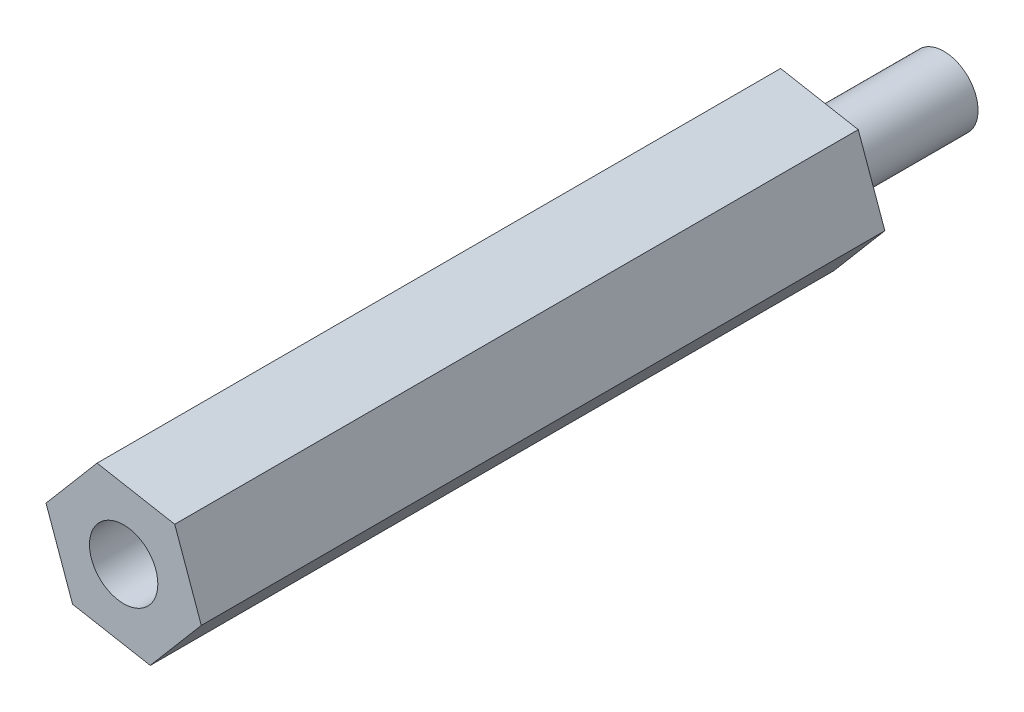
ISO-10303-21;
HEADER;
FILE_DESCRIPTION(('STEP AP214'),'2;1');
FILE_NAME('part.step','',(''),(''),'','','');
FILE_SCHEMA(('AUTOMOTIVE_DESIGN { 1 0 10303 214 1 1 1 1 }'));
ENDSEC;
DATA;
#1=APPLICATION_CONTEXT('core data for automotive mechanical design processes');
#2=APPLICATION_PROTOCOL_DEFINITION('international standard','automotive_design',2000,#1);
#3=PRODUCT_CONTEXT('',#1,'mechanical');
#4=PRODUCT('Part','Part','',(#3));
#5=PRODUCT_RELATED_PRODUCT_CATEGORY('part','',(#4));
#6=PRODUCT_DEFINITION_FORMATION('','',#4);
#7=PRODUCT_DEFINITION_CONTEXT('part definition',#1,'design');
#8=PRODUCT_DEFINITION('design','',#6,#7);
#9=PRODUCT_DEFINITION_SHAPE('','',#8);
#10=(LENGTH_UNIT() NAMED_UNIT(*) SI_UNIT(.MILLI.,.METRE.));
#11=(NAMED_UNIT(*) PLANE_ANGLE_UNIT() SI_UNIT($,.RADIAN.));
#12=(NAMED_UNIT(*) SI_UNIT($,.STERADIAN.) SOLID_ANGLE_UNIT());
#13=UNCERTAINTY_MEASURE_WITH_UNIT(LENGTH_MEASURE(1.E-05),#10,'distance_accuracy_value','');
#14=(GEOMETRIC_REPRESENTATION_CONTEXT(3) GLOBAL_UNCERTAINTY_ASSIGNED_CONTEXT((#13)) GLOBAL_UNIT_ASSIGNED_CONTEXT((#10,
#11,#12)) REPRESENTATION_CONTEXT('',''));
#15=CARTESIAN_POINT('',(0.,0.,0.));
#16=DIRECTION('',(0.,0.,1.));
#17=DIRECTION('',(1.,0.,0.));
#18=AXIS2_PLACEMENT_3D('',#15,#16,#17);
#19=CARTESIAN_POINT('',(10.6919799005155,-6.78529493686556,-6.));
#20=DIRECTION('',(0.,0.,1.));
#21=DIRECTION('',(1.,0.,0.));
#22=AXIS2_PLACEMENT_3D('',#19,#20,#21);
#23=CYLINDRICAL_SURFACE('',#22,1.5);
#24=CARTESIAN_POINT('',(10.6919799005155,-6.78529493686556,-6.));
#25=DIRECTION('',(0.,0.,-1.));
#26=DIRECTION('',(-1.,0.,0.));
#27=AXIS2_PLACEMENT_3D('',#24,#25,#26);
#28=CIRCLE('',#27,1.5);
#29=CARTESIAN_POINT('',(9.19197990051546,-6.78529493686556,-6.));
#30=VERTEX_POINT('',#29);
#31=EDGE_CURVE('E11',#30,#30,#28,.T.);
#32=ORIENTED_EDGE('',*,*,#31,.F.);
#33=EDGE_LOOP('',(#32));
#34=FACE_BOUND('',#33,.T.);
#35=CARTESIAN_POINT('',(10.6919799005155,-6.78529493686556,0.));
#36=DIRECTION('',(0.,0.,-1.));
#37=DIRECTION('',(-1.,0.,0.));
#38=AXIS2_PLACEMENT_3D('',#35,#36,#37);
#39=CIRCLE('',#38,1.5);
#40=CARTESIAN_POINT('',(9.19197990051546,-6.78529493686556,0.));
#41=VERTEX_POINT('',#40);
#42=EDGE_CURVE('E44',#41,#41,#39,.T.);
#43=ORIENTED_EDGE('',*,*,#42,.T.);
#44=EDGE_LOOP('',(#43));
#45=FACE_BOUND('',#44,.T.);
#46=ADVANCED_FACE('F41',(#34,#45),#23,.T.);
#47=CARTESIAN_POINT('',(10.6919799005155,-6.78529493686556,-6.));
#48=DIRECTION('',(0.,0.,-1.));
#49=DIRECTION('',(-1.,0.,0.));
#50=AXIS2_PLACEMENT_3D('',#47,#48,#49);
#51=PLANE('',#50);
#52=ORIENTED_EDGE('',*,*,#31,.T.);
#53=EDGE_LOOP('',(#52));
#54=FACE_BOUND('',#53,.T.);
#55=ADVANCED_FACE('F56',(#54),#51,.T.);
#56=CARTESIAN_POINT('',(10.6919799005155,-6.78529493686556,0.));
#57=DIRECTION('',(0.,0.,-1.));
#58=DIRECTION('',(-1.,0.,0.));
#59=AXIS2_PLACEMENT_3D('',#56,#57,#58);
#60=PLANE('',#59);
#61=ORIENTED_EDGE('',*,*,#42,.F.);
#62=EDGE_LOOP('',(#61));
#63=FACE_BOUND('',#62,.T.);
#64=ADVANCED_FACE('F54',(#63),#60,.F.);
#65=CLOSED_SHELL('',(#46,#55,#64));
#66=MANIFOLD_SOLID_BREP('B2',#65);
#67=CARTESIAN_POINT('',(14.100105118259,-7.40552271774973,30.));
#68=DIRECTION('',(-0.941553473498977,-0.336863557753005,0.));
#69=DIRECTION('',(0.336863557753005,-0.941553473498977,0.));
#70=AXIS2_PLACEMENT_3D('',#67,#68,#69);
#71=PLANE('',#70);
#72=DIRECTION('',(-0.336863557753005,0.941553473498977,0.));
#73=VECTOR('',#72,1.);
#74=CARTESIAN_POINT('',(14.100105118259,-7.40552271774973,0.));
#75=LINE('',#74,#73);
#76=CARTESIAN_POINT('',(14.100105118259,-7.40552271774973,0.));
#77=VERTEX_POINT('',#76);
#78=CARTESIAN_POINT('',(12.9331755237658,-4.14388580946336,0.));
#79=VERTEX_POINT('',#78);
#80=EDGE_CURVE('E166',#77,#79,#75,.T.);
#81=ORIENTED_EDGE('',*,*,#80,.T.);
#82=DIRECTION('',(0.,0.,-1.));
#83=VECTOR('',#82,1.);
#84=CARTESIAN_POINT('',(12.9331755237658,-4.14388580946336,30.));
#85=LINE('',#84,#83);
#86=CARTESIAN_POINT('',(12.9331755237658,-4.14388580946336,30.));
#87=VERTEX_POINT('',#86);
#88=EDGE_CURVE('E39',#87,#79,#85,.T.);
#89=ORIENTED_EDGE('',*,*,#88,.F.);
#90=DIRECTION('',(-0.336863557753005,0.941553473498977,0.));
#91=VECTOR('',#90,1.);
#92=CARTESIAN_POINT('',(14.100105118259,-7.40552271774973,30.));
#93=LINE('',#92,#91);
#94=CARTESIAN_POINT('',(14.100105118259,-7.40552271774973,30.));
#95=VERTEX_POINT('',#94);
#96=EDGE_CURVE('E177',#95,#87,#93,.T.);
#97=ORIENTED_EDGE('',*,*,#96,.F.);
#98=DIRECTION('',(0.,0.,-1.));
#99=VECTOR('',#98,1.);
#100=CARTESIAN_POINT('',(14.100105118259,-7.40552271774973,30.));
#101=LINE('',#100,#99);
#102=EDGE_CURVE('E162',#95,#77,#101,.T.);
#103=ORIENTED_EDGE('',*,*,#102,.T.);
#104=EDGE_LOOP('',(#81,#89,#97,#103));
#105=FACE_BOUND('',#104,.T.);
#106=ADVANCED_FACE('F82',(#105),#71,.F.);
#107=CARTESIAN_POINT('',(12.9331755237658,-4.14388580946336,30.));
#108=DIRECTION('',(-0.17904433812618,-0.983841005948094,0.));
#109=DIRECTION('',(0.983841005948094,-0.17904433812618,0.));
#110=AXIS2_PLACEMENT_3D('',#107,#108,#109);
#111=PLANE('',#110);
#112=DIRECTION('',(-0.983841005948094,0.17904433812618,0.));
#113=VECTOR('',#112,1.);
#114=CARTESIAN_POINT('',(12.9331755237658,-4.14388580946336,0.));
#115=LINE('',#114,#113);
#116=CARTESIAN_POINT('',(9.52505030602222,-3.52365802857919,0.));
#117=VERTEX_POINT('',#116);
#118=EDGE_CURVE('E169',#79,#117,#115,.T.);
#119=ORIENTED_EDGE('',*,*,#118,.T.);
#120=DIRECTION('',(0.,0.,-1.));
#121=VECTOR('',#120,1.);
#122=CARTESIAN_POINT('',(9.52505030602222,-3.52365802857919,30.));
#123=LINE('',#122,#121);
#124=CARTESIAN_POINT('',(9.52505030602222,-3.52365802857919,30.));
#125=VERTEX_POINT('',#124);
#126=EDGE_CURVE('E90',#125,#117,#123,.T.);
#127=ORIENTED_EDGE('',*,*,#126,.F.);
#128=DIRECTION('',(-0.983841005948094,0.17904433812618,0.));
#129=VECTOR('',#128,1.);
#130=CARTESIAN_POINT('',(12.9331755237658,-4.14388580946336,30.));
#131=LINE('',#130,#129);
#132=EDGE_CURVE('E135',#87,#125,#131,.T.);
#133=ORIENTED_EDGE('',*,*,#132,.F.);
#134=ORIENTED_EDGE('',*,*,#88,.T.);
#135=EDGE_LOOP('',(#119,#127,#133,#134));
#136=FACE_BOUND('',#135,.T.);
#137=ADVANCED_FACE('F202',(#136),#111,.F.);
#138=CARTESIAN_POINT('',(9.52505030602222,-3.52365802857919,30.));
#139=DIRECTION('',(0.762509135372797,-0.64697744819509,0.));
#140=DIRECTION('',(0.64697744819509,0.762509135372797,0.));
#141=AXIS2_PLACEMENT_3D('',#138,#139,#140);
#142=PLANE('',#141);
#143=DIRECTION('',(-0.64697744819509,-0.762509135372797,0.));
#144=VECTOR('',#143,1.);
#145=CARTESIAN_POINT('',(9.52505030602222,-3.52365802857919,0.));
#146=LINE('',#145,#144);
#147=CARTESIAN_POINT('',(7.28385468277191,-6.16506715598138,0.));
#148=VERTEX_POINT('',#147);
#149=EDGE_CURVE('E172',#117,#148,#146,.T.);
#150=ORIENTED_EDGE('',*,*,#149,.T.);
#151=DIRECTION('',(0.,0.,-1.));
#152=VECTOR('',#151,1.);
#153=CARTESIAN_POINT('',(7.28385468277191,-6.16506715598138,30.));
#154=LINE('',#153,#152);
#155=CARTESIAN_POINT('',(7.28385468277191,-6.16506715598138,30.));
#156=VERTEX_POINT('',#155);
#157=EDGE_CURVE('E157',#156,#148,#154,.T.);
#158=ORIENTED_EDGE('',*,*,#157,.F.);
#159=DIRECTION('',(-0.64697744819509,-0.762509135372797,0.));
#160=VECTOR('',#159,1.);
#161=CARTESIAN_POINT('',(9.52505030602222,-3.52365802857919,30.));
#162=LINE('',#161,#160);
#163=EDGE_CURVE('E148',#125,#156,#162,.T.);
#164=ORIENTED_EDGE('',*,*,#163,.F.);
#165=ORIENTED_EDGE('',*,*,#126,.T.);
#166=EDGE_LOOP('',(#150,#158,#164,#165));
#167=FACE_BOUND('',#166,.T.);
#168=ADVANCED_FACE('F183',(#167),#142,.F.);
#169=CARTESIAN_POINT('',(7.28385468277191,-6.16506715598138,30.));
#170=DIRECTION('',(0.941553473498977,0.336863557753005,0.));
#171=DIRECTION('',(-0.336863557753005,0.941553473498977,0.));
#172=AXIS2_PLACEMENT_3D('',#169,#170,#171);
#173=PLANE('',#172);
#174=DIRECTION('',(0.336863557753005,-0.941553473498977,0.));
#175=VECTOR('',#174,1.);
#176=CARTESIAN_POINT('',(7.28385468277191,-6.16506715598138,0.));
#177=LINE('',#176,#175);
#178=CARTESIAN_POINT('',(8.45078427726515,-9.42670406426776,0.));
#179=VERTEX_POINT('',#178);
#180=EDGE_CURVE('E156',#148,#179,#177,.T.);
#181=ORIENTED_EDGE('',*,*,#180,.T.);
#182=DIRECTION('',(0.,0.,-1.));
#183=VECTOR('',#182,1.);
#184=CARTESIAN_POINT('',(8.45078427726515,-9.42670406426776,30.));
#185=LINE('',#184,#183);
#186=CARTESIAN_POINT('',(8.45078427726515,-9.42670406426776,30.));
#187=VERTEX_POINT('',#186);
#188=EDGE_CURVE('E153',#187,#179,#185,.T.);
#189=ORIENTED_EDGE('',*,*,#188,.F.);
#190=DIRECTION('',(0.336863557753005,-0.941553473498977,0.));
#191=VECTOR('',#190,1.);
#192=CARTESIAN_POINT('',(7.28385468277191,-6.16506715598138,30.));
#193=LINE('',#192,#191);
#194=EDGE_CURVE('E142',#156,#187,#193,.T.);
#195=ORIENTED_EDGE('',*,*,#194,.F.);
#196=ORIENTED_EDGE('',*,*,#157,.T.);
#197=EDGE_LOOP('',(#181,#189,#195,#196));
#198=FACE_BOUND('',#197,.T.);
#199=ADVANCED_FACE('F154',(#198),#173,.F.);
#200=CARTESIAN_POINT('',(8.45078427726515,-9.42670406426776,30.));
#201=DIRECTION('',(0.17904433812618,0.983841005948094,0.));
#202=DIRECTION('',(-0.983841005948094,0.17904433812618,0.));
#203=AXIS2_PLACEMENT_3D('',#200,#201,#202);
#204=PLANE('',#203);
#205=DIRECTION('',(0.983841005948094,-0.17904433812618,0.));
#206=VECTOR('',#205,1.);
#207=CARTESIAN_POINT('',(8.45078427726515,-9.42670406426776,0.));
#208=LINE('',#207,#206);
#209=CARTESIAN_POINT('',(11.8589094950087,-10.0469318451519,0.));
#210=VERTEX_POINT('',#209);
#211=EDGE_CURVE('E121',#179,#210,#208,.T.);
#212=ORIENTED_EDGE('',*,*,#211,.T.);
#213=DIRECTION('',(0.,0.,-1.));
#214=VECTOR('',#213,1.);
#215=CARTESIAN_POINT('',(11.8589094950087,-10.0469318451519,30.));
#216=LINE('',#215,#214);
#217=CARTESIAN_POINT('',(11.8589094950087,-10.0469318451519,30.));
#218=VERTEX_POINT('',#217);
#219=EDGE_CURVE('E158',#218,#210,#216,.T.);
#220=ORIENTED_EDGE('',*,*,#219,.F.);
#221=DIRECTION('',(0.983841005948094,-0.17904433812618,0.));
#222=VECTOR('',#221,1.);
#223=CARTESIAN_POINT('',(8.45078427726515,-9.42670406426776,30.));
#224=LINE('',#223,#222);
#225=EDGE_CURVE('E146',#187,#218,#224,.T.);
#226=ORIENTED_EDGE('',*,*,#225,.F.);
#227=ORIENTED_EDGE('',*,*,#188,.T.);
#228=EDGE_LOOP('',(#212,#220,#226,#227));
#229=FACE_BOUND('',#228,.T.);
#230=ADVANCED_FACE('F160',(#229),#204,.F.);
#231=CARTESIAN_POINT('',(11.8589094950087,-10.0469318451519,30.));
#232=DIRECTION('',(-0.762509135372797,0.64697744819509,0.));
#233=DIRECTION('',(-0.64697744819509,-0.762509135372797,0.));
#234=AXIS2_PLACEMENT_3D('',#231,#232,#233);
#235=PLANE('',#234);
#236=DIRECTION('',(0.64697744819509,0.762509135372797,0.));
#237=VECTOR('',#236,1.);
#238=CARTESIAN_POINT('',(11.8589094950087,-10.0469318451519,0.));
#239=LINE('',#238,#237);
#240=EDGE_CURVE('E127',#210,#77,#239,.T.);
#241=ORIENTED_EDGE('',*,*,#240,.T.);
#242=ORIENTED_EDGE('',*,*,#102,.F.);
#243=DIRECTION('',(0.64697744819509,0.762509135372797,0.));
#244=VECTOR('',#243,1.);
#245=CARTESIAN_POINT('',(11.8589094950087,-10.0469318451519,30.));
#246=LINE('',#245,#244);
#247=EDGE_CURVE('E98',#218,#95,#246,.T.);
#248=ORIENTED_EDGE('',*,*,#247,.F.);
#249=ORIENTED_EDGE('',*,*,#219,.T.);
#250=EDGE_LOOP('',(#241,#242,#248,#249));
#251=FACE_BOUND('',#250,.T.);
#252=ADVANCED_FACE('F190',(#251),#235,.F.);
#253=CARTESIAN_POINT('',(0.,0.,30.));
#254=DIRECTION('',(0.,0.,1.));
#255=DIRECTION('',(1.,0.,0.));
#256=AXIS2_PLACEMENT_3D('',#253,#254,#255);
#257=PLANE('',#256);
#258=CARTESIAN_POINT('',(10.6919799005155,-6.78529493686556,30.));
#259=DIRECTION('',(0.,0.,1.));
#260=DIRECTION('',(1.,0.,0.));
#261=AXIS2_PLACEMENT_3D('',#258,#259,#260);
#262=CIRCLE('',#261,1.5);
#263=CARTESIAN_POINT('',(12.1919799005155,-6.78529493686556,30.));
#264=VERTEX_POINT('',#263);
#265=EDGE_CURVE('E170',#264,#264,#262,.T.);
#266=ORIENTED_EDGE('',*,*,#265,.F.);
#267=EDGE_LOOP('',(#266));
#268=FACE_BOUND('',#267,.T.);
#269=ORIENTED_EDGE('',*,*,#96,.T.);
#270=ORIENTED_EDGE('',*,*,#132,.T.);
#271=ORIENTED_EDGE('',*,*,#163,.T.);
#272=ORIENTED_EDGE('',*,*,#194,.T.);
#273=ORIENTED_EDGE('',*,*,#225,.T.);
#274=ORIENTED_EDGE('',*,*,#247,.T.);
#275=EDGE_LOOP('',(#269,#270,#271,#272,#273,#274));
#276=FACE_BOUND('',#275,.T.);
#277=ADVANCED_FACE('F144',(#268,#276),#257,.T.);
#278=CARTESIAN_POINT('',(0.,0.,0.));
#279=DIRECTION('',(0.,0.,1.));
#280=DIRECTION('',(1.,0.,0.));
#281=AXIS2_PLACEMENT_3D('',#278,#279,#280);
#282=PLANE('',#281);
#283=CARTESIAN_POINT('',(10.6919799005155,-6.78529493686556,0.));
#284=DIRECTION('',(0.,0.,-1.));
#285=DIRECTION('',(-1.,0.,0.));
#286=AXIS2_PLACEMENT_3D('',#283,#284,#285);
#287=CIRCLE('',#286,1.5);
#288=CARTESIAN_POINT('',(9.19197990051546,-6.78529493686556,0.));
#289=VERTEX_POINT('',#288);
#290=EDGE_CURVE('E257',#289,#289,#287,.T.);
#291=ORIENTED_EDGE('',*,*,#290,.F.);
#292=EDGE_LOOP('',(#291));
#293=FACE_BOUND('',#292,.T.);
#294=ORIENTED_EDGE('',*,*,#80,.F.);
#295=ORIENTED_EDGE('',*,*,#240,.F.);
#296=ORIENTED_EDGE('',*,*,#211,.F.);
#297=ORIENTED_EDGE('',*,*,#180,.F.);
#298=ORIENTED_EDGE('',*,*,#149,.F.);
#299=ORIENTED_EDGE('',*,*,#118,.F.);
#300=EDGE_LOOP('',(#294,#295,#296,#297,#298,#299));
#301=FACE_BOUND('',#300,.T.);
#302=ADVANCED_FACE('F186',(#293,#301),#282,.F.);
#303=CARTESIAN_POINT('',(10.6919799005155,-6.78529493686556,40.));
#304=DIRECTION('',(0.,0.,-1.));
#305=DIRECTION('',(-1.,0.,0.));
#306=AXIS2_PLACEMENT_3D('',#303,#304,#305);
#307=CYLINDRICAL_SURFACE('',#306,1.5);
#308=ORIENTED_EDGE('',*,*,#265,.T.);
#309=EDGE_LOOP('',(#308));
#310=FACE_BOUND('',#309,.T.);
#311=ORIENTED_EDGE('',*,*,#290,.T.);
#312=EDGE_LOOP('',(#311));
#313=FACE_BOUND('',#312,.T.);
#314=ADVANCED_FACE('F239',(#310,#313),#307,.F.);
#315=CLOSED_SHELL('',(#106,#137,#168,#199,#230,#252,#277,#302,#314));
#316=MANIFOLD_SOLID_BREP('B6',#315);
#317=ADVANCED_BREP_SHAPE_REPRESENTATION('',(#18,#66,#316),#14);
#318=SHAPE_DEFINITION_REPRESENTATION(#9,#317);
ENDSEC;
END-ISO-10303-21;
